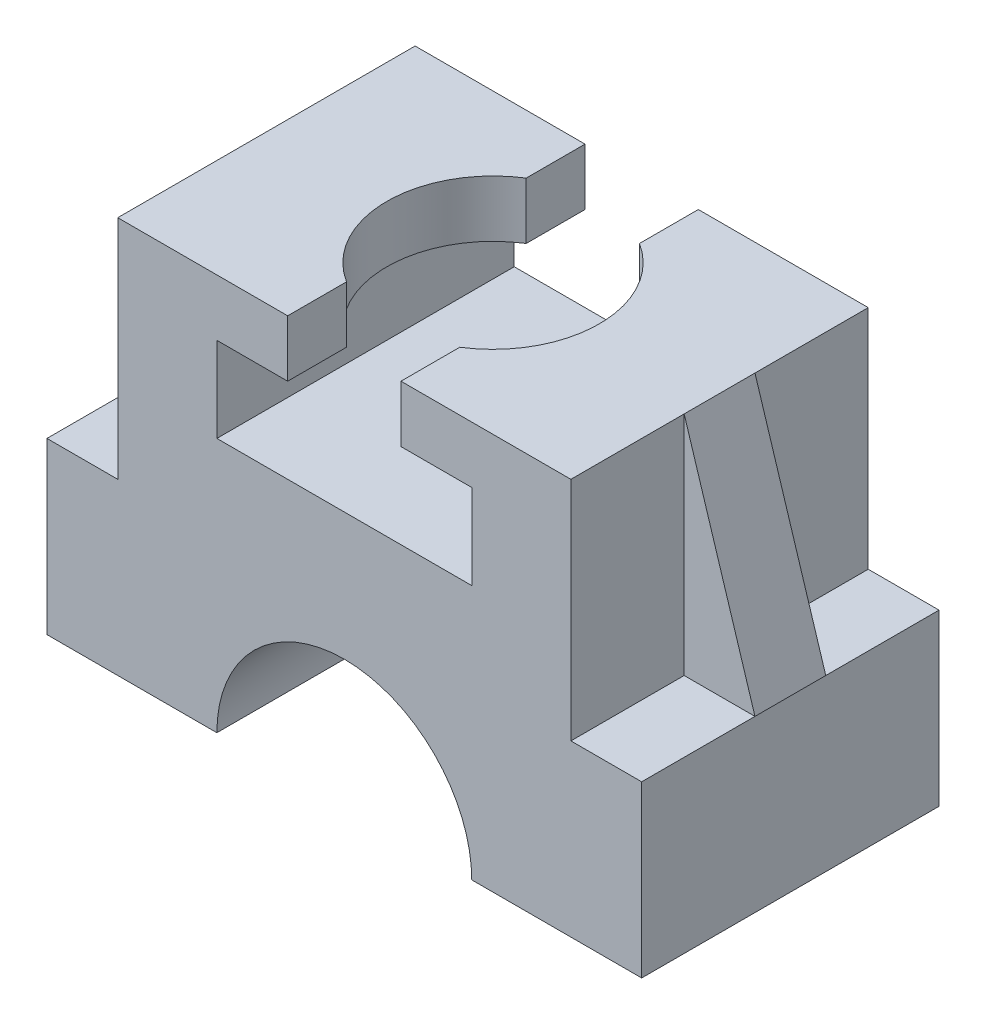
ISO-10303-21;
HEADER;
FILE_DESCRIPTION(('STEP AP214'),'2;1');
FILE_NAME('part.step','',(''),(''),'','','');
FILE_SCHEMA(('AUTOMOTIVE_DESIGN { 1 0 10303 214 1 1 1 1 }'));
ENDSEC;
DATA;
#1=APPLICATION_CONTEXT('core data for automotive mechanical design processes');
#2=APPLICATION_PROTOCOL_DEFINITION('international standard','automotive_design',2000,#1);
#3=PRODUCT_CONTEXT('',#1,'mechanical');
#4=PRODUCT('Part','Part','',(#3));
#5=PRODUCT_RELATED_PRODUCT_CATEGORY('part','',(#4));
#6=PRODUCT_DEFINITION_FORMATION('','',#4);
#7=PRODUCT_DEFINITION_CONTEXT('part definition',#1,'design');
#8=PRODUCT_DEFINITION('design','',#6,#7);
#9=PRODUCT_DEFINITION_SHAPE('','',#8);
#10=(LENGTH_UNIT() NAMED_UNIT(*) SI_UNIT(.MILLI.,.METRE.));
#11=(NAMED_UNIT(*) PLANE_ANGLE_UNIT() SI_UNIT($,.RADIAN.));
#12=(NAMED_UNIT(*) SI_UNIT($,.STERADIAN.) SOLID_ANGLE_UNIT());
#13=UNCERTAINTY_MEASURE_WITH_UNIT(LENGTH_MEASURE(1.E-05),#10,'distance_accuracy_value','');
#14=(GEOMETRIC_REPRESENTATION_CONTEXT(3) GLOBAL_UNCERTAINTY_ASSIGNED_CONTEXT((#13)) GLOBAL_UNIT_ASSIGNED_CONTEXT((#10,
#11,#12)) REPRESENTATION_CONTEXT('',''));
#15=CARTESIAN_POINT('',(0.,0.,0.));
#16=DIRECTION('',(0.,0.,1.));
#17=DIRECTION('',(1.,0.,0.));
#18=AXIS2_PLACEMENT_3D('',#15,#16,#17);
#19=CARTESIAN_POINT('',(-80.,60.,52.5));
#20=DIRECTION('',(-1.,0.,0.));
#21=DIRECTION('',(0.,0.,1.));
#22=AXIS2_PLACEMENT_3D('',#19,#20,#21);
#23=PLANE('',#22);
#24=DIRECTION('',(0.,0.,-1.));
#25=VECTOR('',#24,1.);
#26=CARTESIAN_POINT('',(-80.,60.,52.5));
#27=LINE('',#26,#25);
#28=CARTESIAN_POINT('',(-80.,60.,-12.5));
#29=VERTEX_POINT('',#28);
#30=CARTESIAN_POINT('',(-80.,60.,-52.5));
#31=VERTEX_POINT('',#30);
#32=EDGE_CURVE('E248',#29,#31,#27,.T.);
#33=ORIENTED_EDGE('',*,*,#32,.F.);
#34=DIRECTION('',(0.,1.,0.));
#35=VECTOR('',#34,1.);
#36=CARTESIAN_POINT('',(-80.,60.,-12.5));
#37=LINE('',#36,#35);
#38=CARTESIAN_POINT('',(-80.,140.,-12.5));
#39=VERTEX_POINT('',#38);
#40=EDGE_CURVE('E226',#29,#39,#37,.T.);
#41=ORIENTED_EDGE('',*,*,#40,.T.);
#42=DIRECTION('',(0.,0.,-1.));
#43=VECTOR('',#42,1.);
#44=CARTESIAN_POINT('',(-80.,140.,52.5));
#45=LINE('',#44,#43);
#46=CARTESIAN_POINT('',(-80.,140.,-52.5));
#47=VERTEX_POINT('',#46);
#48=EDGE_CURVE('E256',#39,#47,#45,.T.);
#49=ORIENTED_EDGE('',*,*,#48,.T.);
#50=DIRECTION('',(0.,1.,0.));
#51=VECTOR('',#50,1.);
#52=CARTESIAN_POINT('',(-80.,60.,-52.5));
#53=LINE('',#52,#51);
#54=EDGE_CURVE('E295',#31,#47,#53,.T.);
#55=ORIENTED_EDGE('',*,*,#54,.F.);
#56=EDGE_LOOP('',(#33,#41,#49,#55));
#57=FACE_BOUND('',#56,.T.);
#58=ADVANCED_FACE('F33',(#57),#23,.T.);
#59=CARTESIAN_POINT('',(-105.,60.,52.5));
#60=DIRECTION('',(0.,1.,0.));
#61=DIRECTION('',(0.,0.,1.));
#62=AXIS2_PLACEMENT_3D('',#59,#60,#61);
#63=PLANE('',#62);
#64=DIRECTION('',(0.,0.,-1.));
#65=VECTOR('',#64,1.);
#66=CARTESIAN_POINT('',(-105.,60.,52.5));
#67=LINE('',#66,#65);
#68=CARTESIAN_POINT('',(-105.,60.,-12.5));
#69=VERTEX_POINT('',#68);
#70=CARTESIAN_POINT('',(-105.,60.,-52.5));
#71=VERTEX_POINT('',#70);
#72=EDGE_CURVE('E249',#69,#71,#67,.T.);
#73=ORIENTED_EDGE('',*,*,#72,.F.);
#74=DIRECTION('',(1.,0.,0.));
#75=VECTOR('',#74,1.);
#76=CARTESIAN_POINT('',(-105.,60.,-12.5));
#77=LINE('',#76,#75);
#78=EDGE_CURVE('E447',#69,#29,#77,.T.);
#79=ORIENTED_EDGE('',*,*,#78,.T.);
#80=ORIENTED_EDGE('',*,*,#32,.T.);
#81=DIRECTION('',(1.,0.,0.));
#82=VECTOR('',#81,1.);
#83=CARTESIAN_POINT('',(-105.,60.,-52.5));
#84=LINE('',#83,#82);
#85=EDGE_CURVE('E300',#71,#31,#84,.T.);
#86=ORIENTED_EDGE('',*,*,#85,.F.);
#87=EDGE_LOOP('',(#73,#79,#80,#86));
#88=FACE_BOUND('',#87,.T.);
#89=ADVANCED_FACE('F491',(#88),#63,.T.);
#90=CARTESIAN_POINT('',(105.,60.,52.5));
#91=DIRECTION('',(0.,-1.,0.));
#92=DIRECTION('',(0.,0.,-1.));
#93=AXIS2_PLACEMENT_3D('',#90,#91,#92);
#94=PLANE('',#93);
#95=DIRECTION('',(1.,0.,0.));
#96=VECTOR('',#95,1.);
#97=CARTESIAN_POINT('',(105.,60.,12.5));
#98=LINE('',#97,#96);
#99=CARTESIAN_POINT('',(80.,60.,12.5));
#100=VERTEX_POINT('',#99);
#101=CARTESIAN_POINT('',(105.,60.,12.5));
#102=VERTEX_POINT('',#101);
#103=EDGE_CURVE('E457',#100,#102,#98,.T.);
#104=ORIENTED_EDGE('',*,*,#103,.F.);
#105=DIRECTION('',(0.,0.,-1.));
#106=VECTOR('',#105,1.);
#107=CARTESIAN_POINT('',(80.,60.,52.5));
#108=LINE('',#107,#106);
#109=CARTESIAN_POINT('',(80.,60.,52.5));
#110=VERTEX_POINT('',#109);
#111=EDGE_CURVE('E359',#110,#100,#108,.T.);
#112=ORIENTED_EDGE('',*,*,#111,.F.);
#113=DIRECTION('',(-1.,0.,0.));
#114=VECTOR('',#113,1.);
#115=CARTESIAN_POINT('',(105.,60.,52.5));
#116=LINE('',#115,#114);
#117=CARTESIAN_POINT('',(105.,60.,52.5));
#118=VERTEX_POINT('',#117);
#119=EDGE_CURVE('E403',#118,#110,#116,.T.);
#120=ORIENTED_EDGE('',*,*,#119,.F.);
#121=DIRECTION('',(0.,0.,-1.));
#122=VECTOR('',#121,1.);
#123=CARTESIAN_POINT('',(105.,60.,52.5));
#124=LINE('',#123,#122);
#125=EDGE_CURVE('E363',#118,#102,#124,.T.);
#126=ORIENTED_EDGE('',*,*,#125,.T.);
#127=EDGE_LOOP('',(#104,#112,#120,#126));
#128=FACE_BOUND('',#127,.T.);
#129=ADVANCED_FACE('F493',(#128),#94,.F.);
#130=CARTESIAN_POINT('',(80.,60.,52.5));
#131=DIRECTION('',(-1.,0.,0.));
#132=DIRECTION('',(0.,0.,1.));
#133=AXIS2_PLACEMENT_3D('',#130,#131,#132);
#134=PLANE('',#133);
#135=DIRECTION('',(0.,-1.,0.));
#136=VECTOR('',#135,1.);
#137=CARTESIAN_POINT('',(80.,60.,12.5));
#138=LINE('',#137,#136);
#139=CARTESIAN_POINT('',(80.,140.,12.5));
#140=VERTEX_POINT('',#139);
#141=EDGE_CURVE('E454',#140,#100,#138,.T.);
#142=ORIENTED_EDGE('',*,*,#141,.F.);
#143=DIRECTION('',(0.,0.,-1.));
#144=VECTOR('',#143,1.);
#145=CARTESIAN_POINT('',(80.,140.,52.5));
#146=LINE('',#145,#144);
#147=CARTESIAN_POINT('',(80.,140.,52.5));
#148=VERTEX_POINT('',#147);
#149=EDGE_CURVE('E355',#148,#140,#146,.T.);
#150=ORIENTED_EDGE('',*,*,#149,.F.);
#151=DIRECTION('',(0.,1.,0.));
#152=VECTOR('',#151,1.);
#153=CARTESIAN_POINT('',(80.,60.,52.5));
#154=LINE('',#153,#152);
#155=EDGE_CURVE('E405',#110,#148,#154,.T.);
#156=ORIENTED_EDGE('',*,*,#155,.F.);
#157=ORIENTED_EDGE('',*,*,#111,.T.);
#158=EDGE_LOOP('',(#142,#150,#156,#157));
#159=FACE_BOUND('',#158,.T.);
#160=ADVANCED_FACE('F499',(#159),#134,.F.);
#161=CARTESIAN_POINT('',(20.,140.,52.5));
#162=DIRECTION('',(1.,0.,0.));
#163=DIRECTION('',(0.,1.,0.));
#164=AXIS2_PLACEMENT_3D('',#161,#162,#163);
#165=PLANE('',#164);
#166=DIRECTION('',(0.,0.,-1.));
#167=VECTOR('',#166,1.);
#168=CARTESIAN_POINT('',(20.,120.,52.5));
#169=LINE('',#168,#167);
#170=CARTESIAN_POINT('',(20.,120.,-31.7214438511238));
#171=VERTEX_POINT('',#170);
#172=CARTESIAN_POINT('',(20.,120.,-52.5));
#173=VERTEX_POINT('',#172);
#174=EDGE_CURVE('E346',#171,#173,#169,.T.);
#175=ORIENTED_EDGE('',*,*,#174,.F.);
#176=DIRECTION('',(0.,1.,0.));
#177=VECTOR('',#176,1.);
#178=CARTESIAN_POINT('',(20.0000000000001,-0.00100000000002182,-31.7214438511238));
#179=LINE('',#178,#177);
#180=CARTESIAN_POINT('',(20.,140.,-31.7214438511238));
#181=VERTEX_POINT('',#180);
#182=EDGE_CURVE('E470',#181,#171,#179,.F.);
#183=ORIENTED_EDGE('',*,*,#182,.F.);
#184=DIRECTION('',(0.,0.,-1.));
#185=VECTOR('',#184,1.);
#186=CARTESIAN_POINT('',(20.,140.,52.5));
#187=LINE('',#186,#185);
#188=CARTESIAN_POINT('',(20.,140.,-52.5));
#189=VERTEX_POINT('',#188);
#190=EDGE_CURVE('E350',#181,#189,#187,.T.);
#191=ORIENTED_EDGE('',*,*,#190,.T.);
#192=DIRECTION('',(0.,-1.,0.));
#193=VECTOR('',#192,1.);
#194=CARTESIAN_POINT('',(20.,140.,-52.5));
#195=LINE('',#194,#193);
#196=EDGE_CURVE('E326',#189,#173,#195,.T.);
#197=ORIENTED_EDGE('',*,*,#196,.T.);
#198=EDGE_LOOP('',(#175,#183,#191,#197));
#199=FACE_BOUND('',#198,.T.);
#200=ADVANCED_FACE('F523',(#199),#165,.F.);
#201=CARTESIAN_POINT('',(-20.,140.,52.5));
#202=DIRECTION('',(1.,0.,0.));
#203=DIRECTION('',(0.,1.,0.));
#204=AXIS2_PLACEMENT_3D('',#201,#202,#203);
#205=PLANE('',#204);
#206=DIRECTION('',(0.,1.,0.));
#207=VECTOR('',#206,1.);
#208=CARTESIAN_POINT('',(-20.0000000000001,-0.00100000000002182,-31.7214438511238));
#209=LINE('',#208,#207);
#210=CARTESIAN_POINT('',(-20.,140.,-31.7214438511238));
#211=VERTEX_POINT('',#210);
#212=CARTESIAN_POINT('',(-20.,120.,-31.7214438511238));
#213=VERTEX_POINT('',#212);
#214=EDGE_CURVE('E279',#211,#213,#209,.F.);
#215=ORIENTED_EDGE('',*,*,#214,.T.);
#216=DIRECTION('',(0.,0.,-1.));
#217=VECTOR('',#216,1.);
#218=CARTESIAN_POINT('',(-20.,120.,52.5));
#219=LINE('',#218,#217);
#220=CARTESIAN_POINT('',(-20.,120.,-52.5));
#221=VERTEX_POINT('',#220);
#222=EDGE_CURVE('E263',#213,#221,#219,.T.);
#223=ORIENTED_EDGE('',*,*,#222,.T.);
#224=DIRECTION('',(0.,-1.,0.));
#225=VECTOR('',#224,1.);
#226=CARTESIAN_POINT('',(-20.,140.,-52.5));
#227=LINE('',#226,#225);
#228=CARTESIAN_POINT('',(-20.,140.,-52.5));
#229=VERTEX_POINT('',#228);
#230=EDGE_CURVE('E277',#229,#221,#227,.T.);
#231=ORIENTED_EDGE('',*,*,#230,.F.);
#232=DIRECTION('',(0.,0.,-1.));
#233=VECTOR('',#232,1.);
#234=CARTESIAN_POINT('',(-20.,140.,52.5));
#235=LINE('',#234,#233);
#236=EDGE_CURVE('E260',#211,#229,#235,.T.);
#237=ORIENTED_EDGE('',*,*,#236,.F.);
#238=EDGE_LOOP('',(#215,#223,#231,#237));
#239=FACE_BOUND('',#238,.T.);
#240=ADVANCED_FACE('F274',(#239),#205,.T.);
#241=CARTESIAN_POINT('',(-45.,90.,52.5));
#242=DIRECTION('',(-1.,0.,0.));
#243=DIRECTION('',(0.,0.,1.));
#244=AXIS2_PLACEMENT_3D('',#241,#242,#243);
#245=PLANE('',#244);
#246=DIRECTION('',(0.,1.,0.));
#247=VECTOR('',#246,1.);
#248=CARTESIAN_POINT('',(-45.,90.,-52.5));
#249=LINE('',#248,#247);
#250=CARTESIAN_POINT('',(-45.,90.,-52.5));
#251=VERTEX_POINT('',#250);
#252=CARTESIAN_POINT('',(-45.,120.,-52.5));
#253=VERTEX_POINT('',#252);
#254=EDGE_CURVE('E288',#251,#253,#249,.T.);
#255=ORIENTED_EDGE('',*,*,#254,.T.);
#256=DIRECTION('',(0.,0.,-1.));
#257=VECTOR('',#256,1.);
#258=CARTESIAN_POINT('',(-45.,120.,52.5));
#259=LINE('',#258,#257);
#260=CARTESIAN_POINT('',(-45.,120.,52.5));
#261=VERTEX_POINT('',#260);
#262=EDGE_CURVE('E11',#261,#253,#259,.T.);
#263=ORIENTED_EDGE('',*,*,#262,.F.);
#264=DIRECTION('',(0.,1.,0.));
#265=VECTOR('',#264,1.);
#266=CARTESIAN_POINT('',(-45.,90.,52.5));
#267=LINE('',#266,#265);
#268=CARTESIAN_POINT('',(-45.,90.,52.5));
#269=VERTEX_POINT('',#268);
#270=EDGE_CURVE('E338',#269,#261,#267,.T.);
#271=ORIENTED_EDGE('',*,*,#270,.F.);
#272=DIRECTION('',(0.,0.,-1.));
#273=VECTOR('',#272,1.);
#274=CARTESIAN_POINT('',(-45.,90.,52.5));
#275=LINE('',#274,#273);
#276=EDGE_CURVE('E339',#269,#251,#275,.T.);
#277=ORIENTED_EDGE('',*,*,#276,.T.);
#278=EDGE_LOOP('',(#255,#263,#271,#277));
#279=FACE_BOUND('',#278,.T.);
#280=ADVANCED_FACE('F35',(#279),#245,.F.);
#281=CARTESIAN_POINT('',(-45.,120.,52.5));
#282=DIRECTION('',(0.,1.,0.));
#283=DIRECTION('',(0.,0.,1.));
#284=AXIS2_PLACEMENT_3D('',#281,#282,#283);
#285=PLANE('',#284);
#286=ORIENTED_EDGE('',*,*,#222,.F.);
#287=CARTESIAN_POINT('',(0.,120.,0.));
#288=DIRECTION('',(0.,1.,0.));
#289=DIRECTION('',(0.,0.,1.));
#290=AXIS2_PLACEMENT_3D('',#287,#288,#289);
#291=CIRCLE('',#290,37.5);
#292=CARTESIAN_POINT('',(-20.,120.,31.7214438511238));
#293=VERTEX_POINT('',#292);
#294=EDGE_CURVE('E418',#293,#213,#291,.F.);
#295=ORIENTED_EDGE('',*,*,#294,.F.);
#296=CARTESIAN_POINT('',(-20.,120.,52.5));
#297=VERTEX_POINT('',#296);
#298=EDGE_CURVE('E41',#297,#293,#219,.T.);
#299=ORIENTED_EDGE('',*,*,#298,.F.);
#300=DIRECTION('',(1.,0.,0.));
#301=VECTOR('',#300,1.);
#302=CARTESIAN_POINT('',(-45.,120.,52.5));
#303=LINE('',#302,#301);
#304=EDGE_CURVE('E427',#261,#297,#303,.T.);
#305=ORIENTED_EDGE('',*,*,#304,.F.);
#306=ORIENTED_EDGE('',*,*,#262,.T.);
#307=DIRECTION('',(1.,0.,0.));
#308=VECTOR('',#307,1.);
#309=CARTESIAN_POINT('',(-45.,120.,-52.5));
#310=LINE('',#309,#308);
#311=EDGE_CURVE('E282',#253,#221,#310,.T.);
#312=ORIENTED_EDGE('',*,*,#311,.T.);
#313=EDGE_LOOP('',(#286,#295,#299,#305,#306,#312));
#314=FACE_BOUND('',#313,.T.);
#315=ADVANCED_FACE('F283',(#314),#285,.F.);
#316=DIRECTION('',(0.,1.,0.));
#317=VECTOR('',#316,1.);
#318=CARTESIAN_POINT('',(-20.0000000000001,-0.00100000000002182,31.7214438511238));
#319=LINE('',#318,#317);
#320=CARTESIAN_POINT('',(-20.,140.,31.7214438511238));
#321=VERTEX_POINT('',#320);
#322=EDGE_CURVE('E474',#293,#321,#319,.T.);
#323=ORIENTED_EDGE('',*,*,#322,.T.);
#324=CARTESIAN_POINT('',(-20.,140.,52.5));
#325=VERTEX_POINT('',#324);
#326=EDGE_CURVE('E261',#325,#321,#235,.T.);
#327=ORIENTED_EDGE('',*,*,#326,.F.);
#328=DIRECTION('',(0.,-1.,0.));
#329=VECTOR('',#328,1.);
#330=CARTESIAN_POINT('',(-20.,140.,52.5));
#331=LINE('',#330,#329);
#332=EDGE_CURVE('E429',#325,#297,#331,.T.);
#333=ORIENTED_EDGE('',*,*,#332,.T.);
#334=ORIENTED_EDGE('',*,*,#298,.T.);
#335=EDGE_LOOP('',(#323,#327,#333,#334));
#336=FACE_BOUND('',#335,.T.);
#337=ADVANCED_FACE('F480',(#336),#205,.T.);
#338=CARTESIAN_POINT('',(-80.,140.,52.5));
#339=DIRECTION('',(0.,1.,0.));
#340=DIRECTION('',(-1.,0.,0.));
#341=AXIS2_PLACEMENT_3D('',#338,#339,#340);
#342=PLANE('',#341);
#343=CARTESIAN_POINT('',(0.,140.,0.));
#344=DIRECTION('',(0.,1.,0.));
#345=DIRECTION('',(-1.,0.,0.));
#346=AXIS2_PLACEMENT_3D('',#343,#344,#345);
#347=CIRCLE('',#346,37.5);
#348=EDGE_CURVE('E420',#211,#321,#347,.T.);
#349=ORIENTED_EDGE('',*,*,#348,.F.);
#350=ORIENTED_EDGE('',*,*,#236,.T.);
#351=DIRECTION('',(1.,0.,0.));
#352=VECTOR('',#351,1.);
#353=CARTESIAN_POINT('',(-80.,140.,-52.5));
#354=LINE('',#353,#352);
#355=EDGE_CURVE('E293',#47,#229,#354,.T.);
#356=ORIENTED_EDGE('',*,*,#355,.F.);
#357=ORIENTED_EDGE('',*,*,#48,.F.);
#358=DIRECTION('',(0.,0.,-1.));
#359=VECTOR('',#358,1.);
#360=CARTESIAN_POINT('',(-80.,140.,12.5));
#361=LINE('',#360,#359);
#362=CARTESIAN_POINT('',(-80.,140.,12.5));
#363=VERTEX_POINT('',#362);
#364=EDGE_CURVE('E233',#363,#39,#361,.T.);
#365=ORIENTED_EDGE('',*,*,#364,.F.);
#366=CARTESIAN_POINT('',(-80.,140.,52.5));
#367=VERTEX_POINT('',#366);
#368=EDGE_CURVE('E257',#367,#363,#45,.T.);
#369=ORIENTED_EDGE('',*,*,#368,.F.);
#370=DIRECTION('',(1.,0.,0.));
#371=VECTOR('',#370,1.);
#372=CARTESIAN_POINT('',(-80.,140.,52.5));
#373=LINE('',#372,#371);
#374=EDGE_CURVE('E431',#367,#325,#373,.T.);
#375=ORIENTED_EDGE('',*,*,#374,.T.);
#376=ORIENTED_EDGE('',*,*,#326,.T.);
#377=EDGE_LOOP('',(#349,#350,#356,#357,#365,#369,#375,#376));
#378=FACE_BOUND('',#377,.T.);
#379=ADVANCED_FACE('F483',(#378),#342,.T.);
#380=DIRECTION('',(0.,1.,0.));
#381=VECTOR('',#380,1.);
#382=CARTESIAN_POINT('',(-80.,60.,12.5));
#383=LINE('',#382,#381);
#384=CARTESIAN_POINT('',(-80.,60.,12.5));
#385=VERTEX_POINT('',#384);
#386=EDGE_CURVE('E224',#385,#363,#383,.T.);
#387=ORIENTED_EDGE('',*,*,#386,.F.);
#388=CARTESIAN_POINT('',(-80.,60.,52.5));
#389=VERTEX_POINT('',#388);
#390=EDGE_CURVE('E241',#389,#385,#27,.T.);
#391=ORIENTED_EDGE('',*,*,#390,.F.);
#392=DIRECTION('',(0.,1.,0.));
#393=VECTOR('',#392,1.);
#394=CARTESIAN_POINT('',(-80.,60.,52.5));
#395=LINE('',#394,#393);
#396=EDGE_CURVE('E434',#389,#367,#395,.T.);
#397=ORIENTED_EDGE('',*,*,#396,.T.);
#398=ORIENTED_EDGE('',*,*,#368,.T.);
#399=EDGE_LOOP('',(#387,#391,#397,#398));
#400=FACE_BOUND('',#399,.T.);
#401=ADVANCED_FACE('F442',(#400),#23,.T.);
#402=DIRECTION('',(1.,0.,0.));
#403=VECTOR('',#402,1.);
#404=CARTESIAN_POINT('',(-105.,60.,12.5));
#405=LINE('',#404,#403);
#406=CARTESIAN_POINT('',(-105.,60.,12.5));
#407=VERTEX_POINT('',#406);
#408=EDGE_CURVE('E222',#407,#385,#405,.T.);
#409=ORIENTED_EDGE('',*,*,#408,.F.);
#410=CARTESIAN_POINT('',(-105.,60.,52.5));
#411=VERTEX_POINT('',#410);
#412=EDGE_CURVE('E239',#411,#407,#67,.T.);
#413=ORIENTED_EDGE('',*,*,#412,.F.);
#414=DIRECTION('',(1.,0.,0.));
#415=VECTOR('',#414,1.);
#416=CARTESIAN_POINT('',(-105.,60.,52.5));
#417=LINE('',#416,#415);
#418=EDGE_CURVE('E437',#411,#389,#417,.T.);
#419=ORIENTED_EDGE('',*,*,#418,.T.);
#420=ORIENTED_EDGE('',*,*,#390,.T.);
#421=EDGE_LOOP('',(#409,#413,#419,#420));
#422=FACE_BOUND('',#421,.T.);
#423=ADVANCED_FACE('F237',(#422),#63,.T.);
#424=CARTESIAN_POINT('',(-105.,0.,52.5));
#425=DIRECTION('',(-1.,0.,0.));
#426=DIRECTION('',(0.,-1.,0.));
#427=AXIS2_PLACEMENT_3D('',#424,#425,#426);
#428=PLANE('',#427);
#429=DIRECTION('',(0.,1.,0.));
#430=VECTOR('',#429,1.);
#431=CARTESIAN_POINT('',(-105.,0.,-52.5));
#432=LINE('',#431,#430);
#433=CARTESIAN_POINT('',(-105.,0.,-52.5));
#434=VERTEX_POINT('',#433);
#435=EDGE_CURVE('E303',#434,#71,#432,.T.);
#436=ORIENTED_EDGE('',*,*,#435,.F.);
#437=DIRECTION('',(0.,0.,-1.));
#438=VECTOR('',#437,1.);
#439=CARTESIAN_POINT('',(-105.,0.,52.5));
#440=LINE('',#439,#438);
#441=CARTESIAN_POINT('',(-105.,0.,52.5));
#442=VERTEX_POINT('',#441);
#443=EDGE_CURVE('E252',#442,#434,#440,.T.);
#444=ORIENTED_EDGE('',*,*,#443,.F.);
#445=DIRECTION('',(0.,1.,0.));
#446=VECTOR('',#445,1.);
#447=CARTESIAN_POINT('',(-105.,0.,52.5));
#448=LINE('',#447,#446);
#449=EDGE_CURVE('E247',#442,#411,#448,.T.);
#450=ORIENTED_EDGE('',*,*,#449,.T.);
#451=ORIENTED_EDGE('',*,*,#412,.T.);
#452=DIRECTION('',(0.,0.,-1.));
#453=VECTOR('',#452,1.);
#454=CARTESIAN_POINT('',(-105.,60.,12.5));
#455=LINE('',#454,#453);
#456=EDGE_CURVE('E229',#407,#69,#455,.T.);
#457=ORIENTED_EDGE('',*,*,#456,.T.);
#458=ORIENTED_EDGE('',*,*,#72,.T.);
#459=EDGE_LOOP('',(#436,#444,#450,#451,#457,#458));
#460=FACE_BOUND('',#459,.T.);
#461=ADVANCED_FACE('F245',(#460),#428,.T.);
#462=CARTESIAN_POINT('',(-45.,0.,52.5));
#463=DIRECTION('',(0.,-1.,0.));
#464=DIRECTION('',(0.,0.,-1.));
#465=AXIS2_PLACEMENT_3D('',#462,#463,#464);
#466=PLANE('',#465);
#467=DIRECTION('',(-1.,0.,0.));
#468=VECTOR('',#467,1.);
#469=CARTESIAN_POINT('',(-45.,0.,-52.5));
#470=LINE('',#469,#468);
#471=CARTESIAN_POINT('',(-45.,0.,-52.5));
#472=VERTEX_POINT('',#471);
#473=EDGE_CURVE('E306',#472,#434,#470,.T.);
#474=ORIENTED_EDGE('',*,*,#473,.F.);
#475=DIRECTION('',(0.,0.,-1.));
#476=VECTOR('',#475,1.);
#477=CARTESIAN_POINT('',(-45.,0.,52.5));
#478=LINE('',#477,#476);
#479=CARTESIAN_POINT('',(-45.,0.,52.5));
#480=VERTEX_POINT('',#479);
#481=EDGE_CURVE('E370',#480,#472,#478,.T.);
#482=ORIENTED_EDGE('',*,*,#481,.F.);
#483=DIRECTION('',(-1.,0.,0.));
#484=VECTOR('',#483,1.);
#485=CARTESIAN_POINT('',(-45.,0.,52.5));
#486=LINE('',#485,#484);
#487=EDGE_CURVE('E379',#480,#442,#486,.T.);
#488=ORIENTED_EDGE('',*,*,#487,.T.);
#489=ORIENTED_EDGE('',*,*,#443,.T.);
#490=EDGE_LOOP('',(#474,#482,#488,#489));
#491=FACE_BOUND('',#490,.T.);
#492=ADVANCED_FACE('F377',(#491),#466,.T.);
#493=CARTESIAN_POINT('',(0.,0.,52.5));
#494=DIRECTION('',(0.,0.,-1.));
#495=DIRECTION('',(-1.,0.,0.));
#496=AXIS2_PLACEMENT_3D('',#493,#494,#495);
#497=CYLINDRICAL_SURFACE('',#496,45.);
#498=CARTESIAN_POINT('',(0.,0.,-52.5));
#499=DIRECTION('',(0.,0.,1.));
#500=DIRECTION('',(1.,0.,0.));
#501=AXIS2_PLACEMENT_3D('',#498,#499,#500);
#502=CIRCLE('',#501,45.);
#503=CARTESIAN_POINT('',(45.,0.,-52.5));
#504=VERTEX_POINT('',#503);
#505=EDGE_CURVE('E309',#504,#472,#502,.T.);
#506=ORIENTED_EDGE('',*,*,#505,.F.);
#507=DIRECTION('',(0.,0.,-1.));
#508=VECTOR('',#507,1.);
#509=CARTESIAN_POINT('',(45.,0.,52.5));
#510=LINE('',#509,#508);
#511=CARTESIAN_POINT('',(45.,0.,52.5));
#512=VERTEX_POINT('',#511);
#513=EDGE_CURVE('E369',#512,#504,#510,.T.);
#514=ORIENTED_EDGE('',*,*,#513,.F.);
#515=CARTESIAN_POINT('',(0.,0.,52.5));
#516=DIRECTION('',(0.,0.,1.));
#517=DIRECTION('',(1.,0.,0.));
#518=AXIS2_PLACEMENT_3D('',#515,#516,#517);
#519=CIRCLE('',#518,45.);
#520=EDGE_CURVE('E387',#512,#480,#519,.T.);
#521=ORIENTED_EDGE('',*,*,#520,.T.);
#522=ORIENTED_EDGE('',*,*,#481,.T.);
#523=EDGE_LOOP('',(#506,#514,#521,#522));
#524=FACE_BOUND('',#523,.T.);
#525=ADVANCED_FACE('F384',(#524),#497,.F.);
#526=CARTESIAN_POINT('',(45.,0.,52.5));
#527=DIRECTION('',(0.,1.,0.));
#528=DIRECTION('',(0.,0.,1.));
#529=AXIS2_PLACEMENT_3D('',#526,#527,#528);
#530=PLANE('',#529);
#531=DIRECTION('',(1.,0.,0.));
#532=VECTOR('',#531,1.);
#533=CARTESIAN_POINT('',(45.,0.,-52.5));
#534=LINE('',#533,#532);
#535=CARTESIAN_POINT('',(105.,0.,-52.5));
#536=VERTEX_POINT('',#535);
#537=EDGE_CURVE('E312',#504,#536,#534,.T.);
#538=ORIENTED_EDGE('',*,*,#537,.T.);
#539=DIRECTION('',(0.,0.,-1.));
#540=VECTOR('',#539,1.);
#541=CARTESIAN_POINT('',(105.,0.,52.5));
#542=LINE('',#541,#540);
#543=CARTESIAN_POINT('',(105.,0.,52.5));
#544=VERTEX_POINT('',#543);
#545=EDGE_CURVE('E366',#544,#536,#542,.T.);
#546=ORIENTED_EDGE('',*,*,#545,.F.);
#547=DIRECTION('',(1.,0.,0.));
#548=VECTOR('',#547,1.);
#549=CARTESIAN_POINT('',(45.,0.,52.5));
#550=LINE('',#549,#548);
#551=EDGE_CURVE('E390',#512,#544,#550,.T.);
#552=ORIENTED_EDGE('',*,*,#551,.F.);
#553=ORIENTED_EDGE('',*,*,#513,.T.);
#554=EDGE_LOOP('',(#538,#546,#552,#553));
#555=FACE_BOUND('',#554,.T.);
#556=ADVANCED_FACE('F391',(#555),#530,.F.);
#557=CARTESIAN_POINT('',(105.,0.,52.5));
#558=DIRECTION('',(-1.,0.,0.));
#559=DIRECTION('',(0.,-1.,0.));
#560=AXIS2_PLACEMENT_3D('',#557,#558,#559);
#561=PLANE('',#560);
#562=DIRECTION('',(0.,1.,0.));
#563=VECTOR('',#562,1.);
#564=CARTESIAN_POINT('',(105.,0.,-52.5));
#565=LINE('',#564,#563);
#566=CARTESIAN_POINT('',(105.,60.,-52.5));
#567=VERTEX_POINT('',#566);
#568=EDGE_CURVE('E314',#536,#567,#565,.T.);
#569=ORIENTED_EDGE('',*,*,#568,.T.);
#570=CARTESIAN_POINT('',(105.,60.,-12.5));
#571=VERTEX_POINT('',#570);
#572=EDGE_CURVE('E362',#571,#567,#124,.T.);
#573=ORIENTED_EDGE('',*,*,#572,.F.);
#574=DIRECTION('',(0.,0.,-1.));
#575=VECTOR('',#574,1.);
#576=CARTESIAN_POINT('',(105.,60.,12.5));
#577=LINE('',#576,#575);
#578=EDGE_CURVE('E459',#102,#571,#577,.T.);
#579=ORIENTED_EDGE('',*,*,#578,.F.);
#580=ORIENTED_EDGE('',*,*,#125,.F.);
#581=DIRECTION('',(0.,1.,0.));
#582=VECTOR('',#581,1.);
#583=CARTESIAN_POINT('',(105.,0.,52.5));
#584=LINE('',#583,#582);
#585=EDGE_CURVE('E394',#544,#118,#584,.T.);
#586=ORIENTED_EDGE('',*,*,#585,.F.);
#587=ORIENTED_EDGE('',*,*,#545,.T.);
#588=EDGE_LOOP('',(#569,#573,#579,#580,#586,#587));
#589=FACE_BOUND('',#588,.T.);
#590=ADVANCED_FACE('F580',(#589),#561,.F.);
#591=CARTESIAN_POINT('',(80.,60.,-12.5));
#592=VERTEX_POINT('',#591);
#593=CARTESIAN_POINT('',(80.,60.,-52.5));
#594=VERTEX_POINT('',#593);
#595=EDGE_CURVE('E358',#592,#594,#108,.T.);
#596=ORIENTED_EDGE('',*,*,#595,.F.);
#597=DIRECTION('',(1.,0.,0.));
#598=VECTOR('',#597,1.);
#599=CARTESIAN_POINT('',(105.,60.,-12.5));
#600=LINE('',#599,#598);
#601=EDGE_CURVE('E455',#592,#571,#600,.T.);
#602=ORIENTED_EDGE('',*,*,#601,.T.);
#603=ORIENTED_EDGE('',*,*,#572,.T.);
#604=DIRECTION('',(-1.,0.,0.));
#605=VECTOR('',#604,1.);
#606=CARTESIAN_POINT('',(105.,60.,-52.5));
#607=LINE('',#606,#605);
#608=EDGE_CURVE('E317',#567,#594,#607,.T.);
#609=ORIENTED_EDGE('',*,*,#608,.T.);
#610=EDGE_LOOP('',(#596,#602,#603,#609));
#611=FACE_BOUND('',#610,.T.);
#612=ADVANCED_FACE('F502',(#611),#94,.F.);
#613=CARTESIAN_POINT('',(80.,140.,-12.5));
#614=VERTEX_POINT('',#613);
#615=CARTESIAN_POINT('',(80.,140.,-52.5));
#616=VERTEX_POINT('',#615);
#617=EDGE_CURVE('E354',#614,#616,#146,.T.);
#618=ORIENTED_EDGE('',*,*,#617,.F.);
#619=DIRECTION('',(0.,-1.,0.));
#620=VECTOR('',#619,1.);
#621=CARTESIAN_POINT('',(80.,60.,-12.5));
#622=LINE('',#621,#620);
#623=EDGE_CURVE('E461',#614,#592,#622,.T.);
#624=ORIENTED_EDGE('',*,*,#623,.T.);
#625=ORIENTED_EDGE('',*,*,#595,.T.);
#626=DIRECTION('',(0.,1.,0.));
#627=VECTOR('',#626,1.);
#628=CARTESIAN_POINT('',(80.,60.,-52.5));
#629=LINE('',#628,#627);
#630=EDGE_CURVE('E320',#594,#616,#629,.T.);
#631=ORIENTED_EDGE('',*,*,#630,.T.);
#632=EDGE_LOOP('',(#618,#624,#625,#631));
#633=FACE_BOUND('',#632,.T.);
#634=ADVANCED_FACE('F535',(#633),#134,.F.);
#635=CARTESIAN_POINT('',(80.,140.,52.5));
#636=DIRECTION('',(0.,-1.,0.));
#637=DIRECTION('',(1.,0.,0.));
#638=AXIS2_PLACEMENT_3D('',#635,#636,#637);
#639=PLANE('',#638);
#640=ORIENTED_EDGE('',*,*,#190,.F.);
#641=CARTESIAN_POINT('',(0.,140.,0.));
#642=DIRECTION('',(0.,1.,0.));
#643=DIRECTION('',(-1.,0.,0.));
#644=AXIS2_PLACEMENT_3D('',#641,#642,#643);
#645=CIRCLE('',#644,37.5);
#646=CARTESIAN_POINT('',(20.,140.,31.7214438511238));
#647=VERTEX_POINT('',#646);
#648=EDGE_CURVE('E475',#647,#181,#645,.T.);
#649=ORIENTED_EDGE('',*,*,#648,.F.);
#650=CARTESIAN_POINT('',(20.,140.,52.5));
#651=VERTEX_POINT('',#650);
#652=EDGE_CURVE('E351',#651,#647,#187,.T.);
#653=ORIENTED_EDGE('',*,*,#652,.F.);
#654=DIRECTION('',(-1.,0.,0.));
#655=VECTOR('',#654,1.);
#656=CARTESIAN_POINT('',(80.,140.,52.5));
#657=LINE('',#656,#655);
#658=EDGE_CURVE('E407',#148,#651,#657,.T.);
#659=ORIENTED_EDGE('',*,*,#658,.F.);
#660=ORIENTED_EDGE('',*,*,#149,.T.);
#661=DIRECTION('',(0.,0.,-1.));
#662=VECTOR('',#661,1.);
#663=CARTESIAN_POINT('',(80.,140.,12.5));
#664=LINE('',#663,#662);
#665=EDGE_CURVE('E467',#140,#614,#664,.T.);
#666=ORIENTED_EDGE('',*,*,#665,.T.);
#667=ORIENTED_EDGE('',*,*,#617,.T.);
#668=DIRECTION('',(-1.,0.,0.));
#669=VECTOR('',#668,1.);
#670=CARTESIAN_POINT('',(80.,140.,-52.5));
#671=LINE('',#670,#669);
#672=EDGE_CURVE('E323',#616,#189,#671,.T.);
#673=ORIENTED_EDGE('',*,*,#672,.T.);
#674=EDGE_LOOP('',(#640,#649,#653,#659,#660,#666,#667,#673));
#675=FACE_BOUND('',#674,.T.);
#676=ADVANCED_FACE('F541',(#675),#639,.F.);
#677=ORIENTED_EDGE('',*,*,#652,.T.);
#678=DIRECTION('',(0.,1.,0.));
#679=VECTOR('',#678,1.);
#680=CARTESIAN_POINT('',(20.0000000000001,-0.00100000000002182,31.7214438511238));
#681=LINE('',#680,#679);
#682=CARTESIAN_POINT('',(20.,120.,31.7214438511238));
#683=VERTEX_POINT('',#682);
#684=EDGE_CURVE('E477',#683,#647,#681,.T.);
#685=ORIENTED_EDGE('',*,*,#684,.F.);
#686=CARTESIAN_POINT('',(20.,120.,52.5));
#687=VERTEX_POINT('',#686);
#688=EDGE_CURVE('E347',#687,#683,#169,.T.);
#689=ORIENTED_EDGE('',*,*,#688,.F.);
#690=DIRECTION('',(0.,-1.,0.));
#691=VECTOR('',#690,1.);
#692=CARTESIAN_POINT('',(20.,140.,52.5));
#693=LINE('',#692,#691);
#694=EDGE_CURVE('E409',#651,#687,#693,.T.);
#695=ORIENTED_EDGE('',*,*,#694,.F.);
#696=EDGE_LOOP('',(#677,#685,#689,#695));
#697=FACE_BOUND('',#696,.T.);
#698=ADVANCED_FACE('F529',(#697),#165,.F.);
#699=CARTESIAN_POINT('',(45.,120.,52.5));
#700=DIRECTION('',(0.,-1.,0.));
#701=DIRECTION('',(0.,0.,-1.));
#702=AXIS2_PLACEMENT_3D('',#699,#700,#701);
#703=PLANE('',#702);
#704=CARTESIAN_POINT('',(0.,120.,0.));
#705=DIRECTION('',(0.,-1.,0.));
#706=DIRECTION('',(0.,0.,-1.));
#707=AXIS2_PLACEMENT_3D('',#704,#705,#706);
#708=CIRCLE('',#707,37.5);
#709=EDGE_CURVE('E471',#683,#171,#708,.F.);
#710=ORIENTED_EDGE('',*,*,#709,.T.);
#711=ORIENTED_EDGE('',*,*,#174,.T.);
#712=DIRECTION('',(-1.,0.,0.));
#713=VECTOR('',#712,1.);
#714=CARTESIAN_POINT('',(45.,120.,-52.5));
#715=LINE('',#714,#713);
#716=CARTESIAN_POINT('',(45.,120.,-52.5));
#717=VERTEX_POINT('',#716);
#718=EDGE_CURVE('E329',#717,#173,#715,.T.);
#719=ORIENTED_EDGE('',*,*,#718,.F.);
#720=DIRECTION('',(0.,0.,-1.));
#721=VECTOR('',#720,1.);
#722=CARTESIAN_POINT('',(45.,120.,52.5));
#723=LINE('',#722,#721);
#724=CARTESIAN_POINT('',(45.,120.,52.5));
#725=VERTEX_POINT('',#724);
#726=EDGE_CURVE('E344',#725,#717,#723,.T.);
#727=ORIENTED_EDGE('',*,*,#726,.F.);
#728=DIRECTION('',(-1.,0.,0.));
#729=VECTOR('',#728,1.);
#730=CARTESIAN_POINT('',(45.,120.,52.5));
#731=LINE('',#730,#729);
#732=EDGE_CURVE('E411',#725,#687,#731,.T.);
#733=ORIENTED_EDGE('',*,*,#732,.T.);
#734=ORIENTED_EDGE('',*,*,#688,.T.);
#735=EDGE_LOOP('',(#710,#711,#719,#727,#733,#734));
#736=FACE_BOUND('',#735,.T.);
#737=ADVANCED_FACE('F540',(#736),#703,.T.);
#738=CARTESIAN_POINT('',(45.,90.,52.5));
#739=DIRECTION('',(-1.,0.,0.));
#740=DIRECTION('',(0.,0.,1.));
#741=AXIS2_PLACEMENT_3D('',#738,#739,#740);
#742=PLANE('',#741);
#743=DIRECTION('',(0.,1.,0.));
#744=VECTOR('',#743,1.);
#745=CARTESIAN_POINT('',(45.,90.,-52.5));
#746=LINE('',#745,#744);
#747=CARTESIAN_POINT('',(45.,90.,-52.5));
#748=VERTEX_POINT('',#747);
#749=EDGE_CURVE('E332',#748,#717,#746,.T.);
#750=ORIENTED_EDGE('',*,*,#749,.F.);
#751=DIRECTION('',(0.,0.,-1.));
#752=VECTOR('',#751,1.);
#753=CARTESIAN_POINT('',(45.,90.,52.5));
#754=LINE('',#753,#752);
#755=CARTESIAN_POINT('',(45.,90.,52.5));
#756=VERTEX_POINT('',#755);
#757=EDGE_CURVE('E341',#756,#748,#754,.T.);
#758=ORIENTED_EDGE('',*,*,#757,.F.);
#759=DIRECTION('',(0.,1.,0.));
#760=VECTOR('',#759,1.);
#761=CARTESIAN_POINT('',(45.,90.,52.5));
#762=LINE('',#761,#760);
#763=EDGE_CURVE('E414',#756,#725,#762,.T.);
#764=ORIENTED_EDGE('',*,*,#763,.T.);
#765=ORIENTED_EDGE('',*,*,#726,.T.);
#766=EDGE_LOOP('',(#750,#758,#764,#765));
#767=FACE_BOUND('',#766,.T.);
#768=ADVANCED_FACE('F547',(#767),#742,.T.);
#769=CARTESIAN_POINT('',(-45.,90.,52.5));
#770=DIRECTION('',(0.,1.,0.));
#771=DIRECTION('',(0.,0.,1.));
#772=AXIS2_PLACEMENT_3D('',#769,#770,#771);
#773=PLANE('',#772);
#774=DIRECTION('',(1.,0.,0.));
#775=VECTOR('',#774,1.);
#776=CARTESIAN_POINT('',(-45.,90.,-52.5));
#777=LINE('',#776,#775);
#778=EDGE_CURVE('E335',#251,#748,#777,.T.);
#779=ORIENTED_EDGE('',*,*,#778,.F.);
#780=ORIENTED_EDGE('',*,*,#276,.F.);
#781=DIRECTION('',(1.,0.,0.));
#782=VECTOR('',#781,1.);
#783=CARTESIAN_POINT('',(-45.,90.,52.5));
#784=LINE('',#783,#782);
#785=EDGE_CURVE('E342',#269,#756,#784,.T.);
#786=ORIENTED_EDGE('',*,*,#785,.T.);
#787=ORIENTED_EDGE('',*,*,#757,.T.);
#788=EDGE_LOOP('',(#779,#780,#786,#787));
#789=FACE_BOUND('',#788,.T.);
#790=ADVANCED_FACE('F569',(#789),#773,.T.);
#791=CARTESIAN_POINT('',(0.,0.,52.5));
#792=DIRECTION('',(0.,0.,1.));
#793=DIRECTION('',(1.,0.,0.));
#794=AXIS2_PLACEMENT_3D('',#791,#792,#793);
#795=PLANE('',#794);
#796=ORIENTED_EDGE('',*,*,#270,.T.);
#797=ORIENTED_EDGE('',*,*,#304,.T.);
#798=ORIENTED_EDGE('',*,*,#332,.F.);
#799=ORIENTED_EDGE('',*,*,#374,.F.);
#800=ORIENTED_EDGE('',*,*,#396,.F.);
#801=ORIENTED_EDGE('',*,*,#418,.F.);
#802=ORIENTED_EDGE('',*,*,#449,.F.);
#803=ORIENTED_EDGE('',*,*,#487,.F.);
#804=ORIENTED_EDGE('',*,*,#520,.F.);
#805=ORIENTED_EDGE('',*,*,#551,.T.);
#806=ORIENTED_EDGE('',*,*,#585,.T.);
#807=ORIENTED_EDGE('',*,*,#119,.T.);
#808=ORIENTED_EDGE('',*,*,#155,.T.);
#809=ORIENTED_EDGE('',*,*,#658,.T.);
#810=ORIENTED_EDGE('',*,*,#694,.T.);
#811=ORIENTED_EDGE('',*,*,#732,.F.);
#812=ORIENTED_EDGE('',*,*,#763,.F.);
#813=ORIENTED_EDGE('',*,*,#785,.F.);
#814=EDGE_LOOP('',(#796,#797,#798,#799,#800,#801,#802,#803,#804,#805,#806,#807,#808,#809,#810,
#811,#812,#813));
#815=FACE_BOUND('',#814,.T.);
#816=ADVANCED_FACE('F397',(#815),#795,.T.);
#817=CARTESIAN_POINT('',(0.,0.,-52.5));
#818=DIRECTION('',(0.,0.,1.));
#819=DIRECTION('',(1.,0.,0.));
#820=AXIS2_PLACEMENT_3D('',#817,#818,#819);
#821=PLANE('',#820);
#822=ORIENTED_EDGE('',*,*,#254,.F.);
#823=ORIENTED_EDGE('',*,*,#778,.T.);
#824=ORIENTED_EDGE('',*,*,#749,.T.);
#825=ORIENTED_EDGE('',*,*,#718,.T.);
#826=ORIENTED_EDGE('',*,*,#196,.F.);
#827=ORIENTED_EDGE('',*,*,#672,.F.);
#828=ORIENTED_EDGE('',*,*,#630,.F.);
#829=ORIENTED_EDGE('',*,*,#608,.F.);
#830=ORIENTED_EDGE('',*,*,#568,.F.);
#831=ORIENTED_EDGE('',*,*,#537,.F.);
#832=ORIENTED_EDGE('',*,*,#505,.T.);
#833=ORIENTED_EDGE('',*,*,#473,.T.);
#834=ORIENTED_EDGE('',*,*,#435,.T.);
#835=ORIENTED_EDGE('',*,*,#85,.T.);
#836=ORIENTED_EDGE('',*,*,#54,.T.);
#837=ORIENTED_EDGE('',*,*,#355,.T.);
#838=ORIENTED_EDGE('',*,*,#230,.T.);
#839=ORIENTED_EDGE('',*,*,#311,.F.);
#840=EDGE_LOOP('',(#822,#823,#824,#825,#826,#827,#828,#829,#830,#831,#832,#833,#834,#835,#836,
#837,#838,#839));
#841=FACE_BOUND('',#840,.T.);
#842=ADVANCED_FACE('F290',(#841),#821,.F.);
#843=CARTESIAN_POINT('',(0.,-0.00100000000002876,0.));
#844=DIRECTION('',(0.,1.,0.));
#845=DIRECTION('',(-1.,0.,0.));
#846=AXIS2_PLACEMENT_3D('',#843,#844,#845);
#847=CYLINDRICAL_SURFACE('',#846,37.5);
#848=ORIENTED_EDGE('',*,*,#348,.T.);
#849=ORIENTED_EDGE('',*,*,#322,.F.);
#850=ORIENTED_EDGE('',*,*,#294,.T.);
#851=ORIENTED_EDGE('',*,*,#214,.F.);
#852=EDGE_LOOP('',(#848,#849,#850,#851));
#853=FACE_BOUND('',#852,.T.);
#854=ADVANCED_FACE('F601',(#853),#847,.F.);
#855=CARTESIAN_POINT('',(0.,-0.00100000000002876,0.));
#856=DIRECTION('',(0.,1.,0.));
#857=DIRECTION('',(-1.,0.,0.));
#858=AXIS2_PLACEMENT_3D('',#855,#856,#857);
#859=CYLINDRICAL_SURFACE('',#858,37.5);
#860=ORIENTED_EDGE('',*,*,#182,.T.);
#861=ORIENTED_EDGE('',*,*,#709,.F.);
#862=ORIENTED_EDGE('',*,*,#684,.T.);
#863=ORIENTED_EDGE('',*,*,#648,.T.);
#864=EDGE_LOOP('',(#860,#861,#862,#863));
#865=FACE_BOUND('',#864,.T.);
#866=ADVANCED_FACE('F559',(#865),#859,.F.);
#867=CARTESIAN_POINT('',(80.,140.,12.5));
#868=DIRECTION('',(-0.95447997803503,-0.298274993135947,0.));
#869=DIRECTION('',(0.298274993135947,-0.95447997803503,0.));
#870=AXIS2_PLACEMENT_3D('',#867,#868,#869);
#871=PLANE('',#870);
#872=DIRECTION('',(-0.298274993135947,0.95447997803503,0.));
#873=VECTOR('',#872,1.);
#874=CARTESIAN_POINT('',(80.,140.,-12.5));
#875=LINE('',#874,#873);
#876=EDGE_CURVE('E56',#571,#614,#875,.T.);
#877=ORIENTED_EDGE('',*,*,#876,.T.);
#878=ORIENTED_EDGE('',*,*,#665,.F.);
#879=DIRECTION('',(-0.298274993135947,0.95447997803503,0.));
#880=VECTOR('',#879,1.);
#881=CARTESIAN_POINT('',(80.,140.,12.5));
#882=LINE('',#881,#880);
#883=EDGE_CURVE('E452',#102,#140,#882,.T.);
#884=ORIENTED_EDGE('',*,*,#883,.F.);
#885=ORIENTED_EDGE('',*,*,#578,.T.);
#886=EDGE_LOOP('',(#877,#878,#884,#885));
#887=FACE_BOUND('',#886,.T.);
#888=ADVANCED_FACE('F592',(#887),#871,.F.);
#889=CARTESIAN_POINT('',(0.,0.,12.5));
#890=DIRECTION('',(0.,0.,-1.));
#891=DIRECTION('',(-1.,0.,0.));
#892=AXIS2_PLACEMENT_3D('',#889,#890,#891);
#893=PLANE('',#892);
#894=ORIENTED_EDGE('',*,*,#883,.T.);
#895=ORIENTED_EDGE('',*,*,#141,.T.);
#896=ORIENTED_EDGE('',*,*,#103,.T.);
#897=EDGE_LOOP('',(#894,#895,#896));
#898=FACE_BOUND('',#897,.T.);
#899=ADVANCED_FACE('F590',(#898),#893,.F.);
#900=CARTESIAN_POINT('',(0.,0.,-12.5));
#901=DIRECTION('',(0.,0.,-1.));
#902=DIRECTION('',(-1.,0.,0.));
#903=AXIS2_PLACEMENT_3D('',#900,#901,#902);
#904=PLANE('',#903);
#905=ORIENTED_EDGE('',*,*,#876,.F.);
#906=ORIENTED_EDGE('',*,*,#601,.F.);
#907=ORIENTED_EDGE('',*,*,#623,.F.);
#908=EDGE_LOOP('',(#905,#906,#907));
#909=FACE_BOUND('',#908,.T.);
#910=ADVANCED_FACE('F599',(#909),#904,.T.);
#911=CARTESIAN_POINT('',(-80.,140.,12.5));
#912=DIRECTION('',(0.95447997803503,-0.298274993135947,0.));
#913=DIRECTION('',(0.298274993135947,0.95447997803503,0.));
#914=AXIS2_PLACEMENT_3D('',#911,#912,#913);
#915=PLANE('',#914);
#916=DIRECTION('',(-0.298274993135947,-0.95447997803503,0.));
#917=VECTOR('',#916,1.);
#918=CARTESIAN_POINT('',(-80.,140.,-12.5));
#919=LINE('',#918,#917);
#920=EDGE_CURVE('E48',#39,#69,#919,.T.);
#921=ORIENTED_EDGE('',*,*,#920,.T.);
#922=ORIENTED_EDGE('',*,*,#456,.F.);
#923=DIRECTION('',(-0.298274993135947,-0.95447997803503,0.));
#924=VECTOR('',#923,1.);
#925=CARTESIAN_POINT('',(-80.,140.,12.5));
#926=LINE('',#925,#924);
#927=EDGE_CURVE('E219',#363,#407,#926,.T.);
#928=ORIENTED_EDGE('',*,*,#927,.F.);
#929=ORIENTED_EDGE('',*,*,#364,.T.);
#930=EDGE_LOOP('',(#921,#922,#928,#929));
#931=FACE_BOUND('',#930,.T.);
#932=ADVANCED_FACE('F230',(#931),#915,.F.);
#933=CARTESIAN_POINT('',(0.,0.,12.5));
#934=DIRECTION('',(0.,0.,1.));
#935=DIRECTION('',(1.,0.,0.));
#936=AXIS2_PLACEMENT_3D('',#933,#934,#935);
#937=PLANE('',#936);
#938=ORIENTED_EDGE('',*,*,#927,.T.);
#939=ORIENTED_EDGE('',*,*,#408,.T.);
#940=ORIENTED_EDGE('',*,*,#386,.T.);
#941=EDGE_LOOP('',(#938,#939,#940));
#942=FACE_BOUND('',#941,.T.);
#943=ADVANCED_FACE('F220',(#942),#937,.T.);
#944=CARTESIAN_POINT('',(0.,0.,-12.5));
#945=DIRECTION('',(0.,0.,1.));
#946=DIRECTION('',(1.,0.,0.));
#947=AXIS2_PLACEMENT_3D('',#944,#945,#946);
#948=PLANE('',#947);
#949=ORIENTED_EDGE('',*,*,#920,.F.);
#950=ORIENTED_EDGE('',*,*,#40,.F.);
#951=ORIENTED_EDGE('',*,*,#78,.F.);
#952=EDGE_LOOP('',(#949,#950,#951));
#953=FACE_BOUND('',#952,.T.);
#954=ADVANCED_FACE('F486',(#953),#948,.F.);
#955=CLOSED_SHELL('',(#58,#89,#129,#160,#200,#240,#280,#315,#337,#379,#401,#423,#461,#492,#525,
#556,#590,#612,#634,#676,#698,#737,#768,#790,#816,#842,#854,#866,#888,#899,#910,#932,#943,#954));
#956=MANIFOLD_SOLID_BREP('B2',#955);
#957=ADVANCED_BREP_SHAPE_REPRESENTATION('',(#18,#956),#14);
#958=SHAPE_DEFINITION_REPRESENTATION(#9,#957);
ENDSEC;
END-ISO-10303-21;
